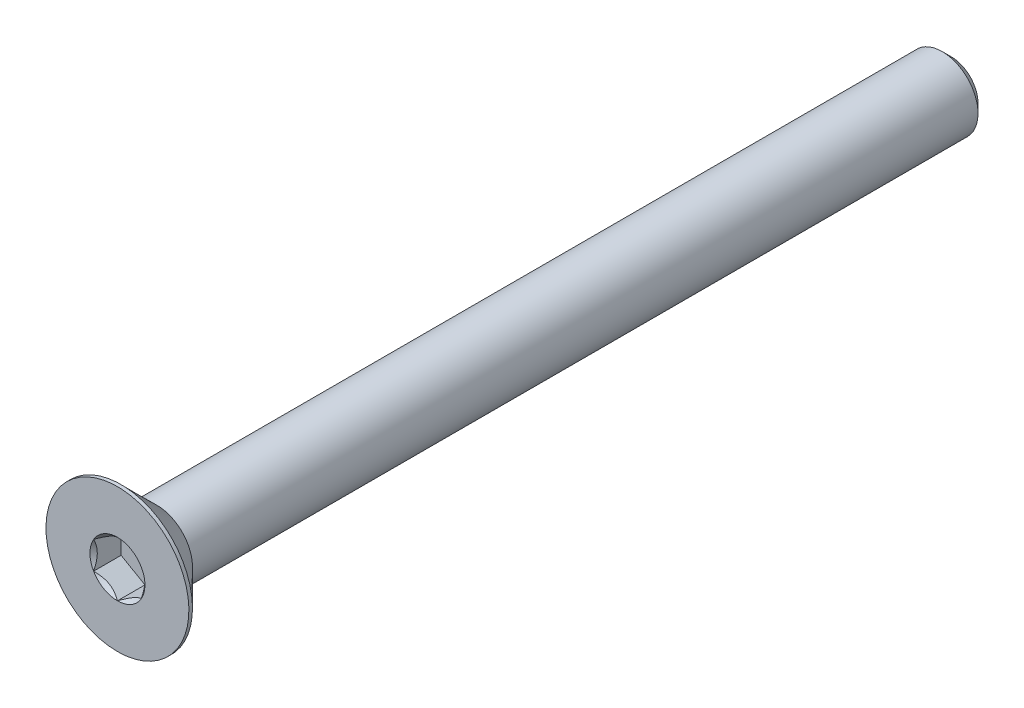
ISO-10303-21;
HEADER;
FILE_DESCRIPTION(('STEP AP214'),'2;1');
FILE_NAME('part.step','',(''),(''),'','','');
FILE_SCHEMA(('AUTOMOTIVE_DESIGN { 1 0 10303 214 1 1 1 1 }'));
ENDSEC;
DATA;
#1=APPLICATION_CONTEXT('core data for automotive mechanical design processes');
#2=APPLICATION_PROTOCOL_DEFINITION('international standard','automotive_design',2000,#1);
#3=PRODUCT_CONTEXT('',#1,'mechanical');
#4=PRODUCT('Part','Part','',(#3));
#5=PRODUCT_RELATED_PRODUCT_CATEGORY('part','',(#4));
#6=PRODUCT_DEFINITION_FORMATION('','',#4);
#7=PRODUCT_DEFINITION_CONTEXT('part definition',#1,'design');
#8=PRODUCT_DEFINITION('design','',#6,#7);
#9=PRODUCT_DEFINITION_SHAPE('','',#8);
#10=(LENGTH_UNIT() NAMED_UNIT(*) SI_UNIT(.MILLI.,.METRE.));
#11=(NAMED_UNIT(*) PLANE_ANGLE_UNIT() SI_UNIT($,.RADIAN.));
#12=(NAMED_UNIT(*) SI_UNIT($,.STERADIAN.) SOLID_ANGLE_UNIT());
#13=UNCERTAINTY_MEASURE_WITH_UNIT(LENGTH_MEASURE(1.E-05),#10,'distance_accuracy_value','');
#14=(GEOMETRIC_REPRESENTATION_CONTEXT(3) GLOBAL_UNCERTAINTY_ASSIGNED_CONTEXT((#13)) GLOBAL_UNIT_ASSIGNED_CONTEXT((#10,
#11,#12)) REPRESENTATION_CONTEXT('',''));
#15=CARTESIAN_POINT('',(0.,0.,0.));
#16=DIRECTION('',(0.,0.,1.));
#17=DIRECTION('',(1.,0.,0.));
#18=AXIS2_PLACEMENT_3D('',#15,#16,#17);
#19=CARTESIAN_POINT('',(0.,0.,-70.));
#20=DIRECTION('',(0.,0.,-1.));
#21=DIRECTION('',(0.,1.,0.));
#22=AXIS2_PLACEMENT_3D('',#19,#20,#21);
#23=CYLINDRICAL_SURFACE('',#22,3.);
#24=CARTESIAN_POINT('',(0.,0.,-69.25));
#25=DIRECTION('',(0.,0.,-1.));
#26=DIRECTION('',(0.,1.,0.));
#27=AXIS2_PLACEMENT_3D('',#24,#25,#26);
#28=CIRCLE('',#27,3.);
#29=CARTESIAN_POINT('',(0.,3.,-69.25));
#30=VERTEX_POINT('',#29);
#31=EDGE_CURVE('E48',#30,#30,#28,.F.);
#32=ORIENTED_EDGE('',*,*,#31,.T.);
#33=EDGE_LOOP('',(#32));
#34=FACE_BOUND('',#33,.T.);
#35=CARTESIAN_POINT('',(0.,0.,-3.3));
#36=DIRECTION('',(0.,0.,1.));
#37=DIRECTION('',(0.,-1.,0.));
#38=AXIS2_PLACEMENT_3D('',#35,#36,#37);
#39=CIRCLE('',#38,3.00000000000001);
#40=CARTESIAN_POINT('',(0.,-3.00000000000001,-3.29999999999999));
#41=VERTEX_POINT('',#40);
#42=EDGE_CURVE('E166',#41,#41,#39,.T.);
#43=ORIENTED_EDGE('',*,*,#42,.F.);
#44=EDGE_LOOP('',(#43));
#45=FACE_BOUND('',#44,.T.);
#46=ADVANCED_FACE('F35',(#34,#45),#23,.T.);
#47=CARTESIAN_POINT('',(0.,-3.,-70.));
#48=DIRECTION('',(0.,0.,-1.));
#49=DIRECTION('',(0.,1.,0.));
#50=AXIS2_PLACEMENT_3D('',#47,#48,#49);
#51=PLANE('',#50);
#52=CARTESIAN_POINT('',(0.,0.,-70.));
#53=DIRECTION('',(0.,0.,-1.));
#54=DIRECTION('',(0.,1.,0.));
#55=AXIS2_PLACEMENT_3D('',#52,#53,#54);
#56=CIRCLE('',#55,2.25);
#57=CARTESIAN_POINT('',(0.,2.25,-70.));
#58=VERTEX_POINT('',#57);
#59=EDGE_CURVE('E175',#58,#58,#56,.T.);
#60=ORIENTED_EDGE('',*,*,#59,.T.);
#61=EDGE_LOOP('',(#60));
#62=FACE_BOUND('',#61,.T.);
#63=ADVANCED_FACE('F185',(#62),#51,.T.);
#64=CARTESIAN_POINT('',(0.,0.,-70.));
#65=DIRECTION('',(0.,0.,1.));
#66=DIRECTION('',(0.,-1.,0.));
#67=AXIS2_PLACEMENT_3D('',#64,#65,#66);
#68=CONICAL_SURFACE('',#67,2.25,0.785398163397443);
#69=ORIENTED_EDGE('',*,*,#31,.F.);
#70=EDGE_LOOP('',(#69));
#71=FACE_BOUND('',#70,.T.);
#72=ORIENTED_EDGE('',*,*,#59,.F.);
#73=EDGE_LOOP('',(#72));
#74=FACE_BOUND('',#73,.T.);
#75=ADVANCED_FACE('F37',(#71,#74),#68,.T.);
#76=CARTESIAN_POINT('',(0.,0.,0.));
#77=DIRECTION('',(0.,0.,1.));
#78=DIRECTION('',(0.,-1.,0.));
#79=AXIS2_PLACEMENT_3D('',#76,#77,#78);
#80=CYLINDRICAL_SURFACE('',#79,6.);
#81=CARTESIAN_POINT('',(0.,0.,0.));
#82=DIRECTION('',(0.,0.,1.));
#83=DIRECTION('',(0.,-1.,0.));
#84=AXIS2_PLACEMENT_3D('',#81,#82,#83);
#85=CIRCLE('',#84,6.);
#86=CARTESIAN_POINT('',(0.,-6.,0.));
#87=VERTEX_POINT('',#86);
#88=EDGE_CURVE('E172',#87,#87,#85,.T.);
#89=ORIENTED_EDGE('',*,*,#88,.F.);
#90=EDGE_LOOP('',(#89));
#91=FACE_BOUND('',#90,.T.);
#92=CARTESIAN_POINT('',(0.,0.,-0.300000000000012));
#93=DIRECTION('',(0.,0.,1.));
#94=DIRECTION('',(0.,-1.,0.));
#95=AXIS2_PLACEMENT_3D('',#92,#93,#94);
#96=CIRCLE('',#95,6.);
#97=CARTESIAN_POINT('',(0.,-6.,-0.300000000000005));
#98=VERTEX_POINT('',#97);
#99=EDGE_CURVE('E169',#98,#98,#96,.T.);
#100=ORIENTED_EDGE('',*,*,#99,.T.);
#101=EDGE_LOOP('',(#100));
#102=FACE_BOUND('',#101,.T.);
#103=ADVANCED_FACE('F184',(#91,#102),#80,.T.);
#104=CARTESIAN_POINT('',(0.,0.,-3.3));
#105=DIRECTION('',(0.,0.,1.));
#106=DIRECTION('',(0.,-1.,0.));
#107=AXIS2_PLACEMENT_3D('',#104,#105,#106);
#108=CONICAL_SURFACE('',#107,3.00000000000001,0.785398163397449);
#109=ORIENTED_EDGE('',*,*,#99,.F.);
#110=EDGE_LOOP('',(#109));
#111=FACE_BOUND('',#110,.T.);
#112=ORIENTED_EDGE('',*,*,#42,.T.);
#113=EDGE_LOOP('',(#112));
#114=FACE_BOUND('',#113,.T.);
#115=ADVANCED_FACE('F195',(#111,#114),#108,.T.);
#116=CARTESIAN_POINT('',(0.,-3.,0.));
#117=DIRECTION('',(0.,0.,1.));
#118=DIRECTION('',(0.,-1.,0.));
#119=AXIS2_PLACEMENT_3D('',#116,#117,#118);
#120=PLANE('',#119);
#121=CARTESIAN_POINT('',(0.,0.,0.));
#122=DIRECTION('',(0.,0.,1.));
#123=DIRECTION('',(1.,0.,0.));
#124=AXIS2_PLACEMENT_3D('',#121,#122,#123);
#125=CIRCLE('',#124,2.3094010767585);
#126=CARTESIAN_POINT('',(0.,-2.3094010767585,0.));
#127=VERTEX_POINT('',#126);
#128=CARTESIAN_POINT('',(2.,-1.15470053837925,0.));
#129=VERTEX_POINT('',#128);
#130=EDGE_CURVE('E94',#127,#129,#125,.T.);
#131=ORIENTED_EDGE('',*,*,#130,.F.);
#132=CARTESIAN_POINT('',(-2.,-1.15470053837925,0.));
#133=VERTEX_POINT('',#132);
#134=EDGE_CURVE('E54',#133,#127,#125,.T.);
#135=ORIENTED_EDGE('',*,*,#134,.F.);
#136=CARTESIAN_POINT('',(-2.,1.15470053837925,0.));
#137=VERTEX_POINT('',#136);
#138=EDGE_CURVE('E136',#137,#133,#125,.T.);
#139=ORIENTED_EDGE('',*,*,#138,.F.);
#140=CARTESIAN_POINT('',(0.,2.3094010767585,0.));
#141=VERTEX_POINT('',#140);
#142=EDGE_CURVE('E61',#141,#137,#125,.T.);
#143=ORIENTED_EDGE('',*,*,#142,.F.);
#144=CARTESIAN_POINT('',(2.,1.15470053837925,0.));
#145=VERTEX_POINT('',#144);
#146=EDGE_CURVE('E130',#145,#141,#125,.T.);
#147=ORIENTED_EDGE('',*,*,#146,.F.);
#148=EDGE_CURVE('E102',#129,#145,#125,.T.);
#149=ORIENTED_EDGE('',*,*,#148,.F.);
#150=EDGE_LOOP('',(#131,#135,#139,#143,#147,#149));
#151=FACE_BOUND('',#150,.T.);
#152=ORIENTED_EDGE('',*,*,#88,.T.);
#153=EDGE_LOOP('',(#152));
#154=FACE_BOUND('',#153,.T.);
#155=ADVANCED_FACE('F128',(#151,#154),#120,.T.);
#156=CARTESIAN_POINT('',(0.,0.,0.));
#157=DIRECTION('',(0.,0.,1.));
#158=DIRECTION('',(1.,0.,0.));
#159=AXIS2_PLACEMENT_3D('',#156,#157,#158);
#160=CONICAL_SURFACE('',#159,2.3094010767585,0.78539816339745);
#161=ORIENTED_EDGE('',*,*,#148,.T.);
#162=CARTESIAN_POINT('',(2.,-2.3029441732643,0.740771355280704));
#163=CARTESIAN_POINT('',(2.,-2.24687002696279,0.698443273869204));
#164=CARTESIAN_POINT('',(2.,-2.19048190568583,0.656525157097849));
#165=CARTESIAN_POINT('',(2.,-2.07695390526152,0.573690418075127));
#166=CARTESIAN_POINT('',(2.,-2.01981384095229,0.53277404987251));
#167=CARTESIAN_POINT('',(2.,-1.90424016831614,0.451833452203585));
#168=CARTESIAN_POINT('',(2.,-1.84579996769763,0.411818591735152));
#169=CARTESIAN_POINT('',(2.,-1.72792745485625,0.33328899382026));
#170=CARTESIAN_POINT('',(2.,-1.66849521315186,0.294774150389528));
#171=CARTESIAN_POINT('',(2.,-1.48162995729573,0.17764065172027));
#172=CARTESIAN_POINT('',(2.,-1.35220318180736,0.102145901825278));
#173=CARTESIAN_POINT('',(2.,-1.08689521605219,-0.035950648947696));
#174=CARTESIAN_POINT('',(2.,-0.951037764035625,-0.0985959140559766));
#175=CARTESIAN_POINT('',(2.,-0.747111912337646,-0.175236456097241));
#176=CARTESIAN_POINT('',(2.,-0.682064034234152,-0.197232820052757));
#177=CARTESIAN_POINT('',(2.,-0.550398103397368,-0.23600331231236));
#178=CARTESIAN_POINT('',(2.,-0.483779942833393,-0.25277708085244));
#179=CARTESIAN_POINT('',(2.,-0.350484328974901,-0.279951742093306));
#180=CARTESIAN_POINT('',(2.,-0.283829489500056,-0.290461823239021));
#181=CARTESIAN_POINT('',(2.,-0.149806987290426,-0.304903914443519));
#182=CARTESIAN_POINT('',(2.,-0.0824394490929267,-0.308837055260091));
#183=CARTESIAN_POINT('',(2.,0.0499055621213762,-0.309833523070379));
#184=CARTESIAN_POINT('',(2.,0.114881284963485,-0.307140355159719));
#185=CARTESIAN_POINT('',(2.,0.244275921290584,-0.295569929600436));
#186=CARTESIAN_POINT('',(2.,0.308694780068661,-0.286692071196874));
#187=CARTESIAN_POINT('',(2.,0.437599788400934,-0.26308634074856));
#188=CARTESIAN_POINT('',(2.,0.502067428429079,-0.248258916605879));
#189=CARTESIAN_POINT('',(2.,0.629594322371855,-0.213542116439957));
#190=CARTESIAN_POINT('',(2.,0.692653693651508,-0.193653163969504));
#191=CARTESIAN_POINT('',(2.,0.891187888928463,-0.123553020856597));
#192=CARTESIAN_POINT('',(2.,1.02383545674826,-0.0653581998253442));
#193=CARTESIAN_POINT('',(2.,1.28290932109378,0.0640305752408587));
#194=CARTESIAN_POINT('',(2.,1.40931112542932,0.13527123115829));
#195=CARTESIAN_POINT('',(2.,1.59200441388854,0.246441991562721));
#196=CARTESIAN_POINT('',(2.,1.65027548974481,0.283182190008324));
#197=CARTESIAN_POINT('',(2.,1.76581760334353,0.358214513820533));
#198=CARTESIAN_POINT('',(2.,1.82308856486637,0.396506756737678));
#199=CARTESIAN_POINT('',(2.,1.93629654702499,0.474042263666801));
#200=CARTESIAN_POINT('',(2.,1.99224062439414,0.513275275702229));
#201=CARTESIAN_POINT('',(2.,2.10336423965704,0.592778830271317));
#202=CARTESIAN_POINT('',(2.,2.15854398356743,0.633049084518487));
#203=CARTESIAN_POINT('',(2.,2.21340370625405,0.673744237646943));
#204=B_SPLINE_CURVE_WITH_KNOTS('',3,(#162,#163,#164,#165,#166,#167,#168,#169,#170,#171,#172,
#173,#174,#175,#176,#177,#178,#179,#180,#181,#182,#183,#184,#185,#186,#187,#188,#189,#190,#191,
#192,#193,#194,#195,#196,#197,#198,#199,#200,#201,#202,#203),.UNSPECIFIED.,.F.,.F.,(4,2,2,2,2,2,
2,2,2,2,2,2,2,2,2,2,2,2,2,2,4),(0.,0.210772732017009,0.421598374738838,0.634057554744621,
0.846501696032181,1.29562155480994,1.74319622856097,1.94902062142334,2.15485918958132,
2.35699582530216,2.55909770457495,2.75388435576874,2.94868993036093,3.14690093471669,
3.34509535806591,3.77838155838771,4.21325029906866,4.41989056664096,4.62654651432579,
4.83152377076248,5.03644465872344),.UNSPECIFIED.);
#205=EDGE_CURVE('E11',#129,#145,#204,.T.);
#206=ORIENTED_EDGE('',*,*,#205,.F.);
#207=EDGE_LOOP('',(#161,#206));
#208=FACE_BOUND('',#207,.T.);
#209=ADVANCED_FACE('F106',(#208),#160,.F.);
#210=ORIENTED_EDGE('',*,*,#146,.T.);
#211=CARTESIAN_POINT('',(2.0002,1.15458506832541,0.000115478713658772));
#212=CARTESIAN_POINT('',(1.93144696596929,1.19427965103065,-0.0395469097744085));
#213=CARTESIAN_POINT('',(1.86154425786449,1.23463799837204,-0.0768800177158387));
#214=CARTESIAN_POINT('',(1.71900475544956,1.31693321846145,-0.145236314863858));
#215=CARTESIAN_POINT('',(1.64635440243464,1.35887791933134,-0.17622146626278));
#216=CARTESIAN_POINT('',(1.49985839894603,1.44345742638069,-0.229299783455858));
#217=CARTESIAN_POINT('',(1.4260500647537,1.48607068799507,-0.251526372823389));
#218=CARTESIAN_POINT('',(1.27680836816474,1.57223542169503,-0.28577118332492));
#219=CARTESIAN_POINT('',(1.20137956608185,1.61578426088223,-0.297814970855866));
#220=CARTESIAN_POINT('',(1.07138449932892,1.69083694766536,-0.308681488094429));
#221=CARTESIAN_POINT('',(1.01698621602989,1.72224381117151,-0.31029024639003));
#222=CARTESIAN_POINT('',(0.908278544480306,1.78500621460364,-0.307581122401289));
#223=CARTESIAN_POINT('',(0.85396919407866,1.81636173267754,-0.303261162242026));
#224=CARTESIAN_POINT('',(0.745863272410661,1.87877671565355,-0.288940432590095));
#225=CARTESIAN_POINT('',(0.692067343445207,1.90983580972306,-0.278933307237994));
#226=CARTESIAN_POINT('',(0.585405737694425,1.97141691651548,-0.253787569750341));
#227=CARTESIAN_POINT('',(0.532539989929286,2.00193897021859,-0.23864935095776));
#228=CARTESIAN_POINT('',(0.397120266910155,2.08012358375727,-0.193705496570809));
#229=CARTESIAN_POINT('',(0.315406165150521,2.12730124240478,-0.160511160574184));
#230=CARTESIAN_POINT('',(0.195252962742197,2.19667172615922,-0.10447417682863));
#231=CARTESIAN_POINT('',(0.155657147890823,2.21953238052245,-0.0847852970530602));
#232=CARTESIAN_POINT('',(0.0771990411121277,2.26483018959124,-0.043612681635129));
#233=CARTESIAN_POINT('',(0.0383363164062597,2.28726759416161,-0.0221300483487535));
#234=CARTESIAN_POINT('',(-0.000199999999999904,2.30951654681234,0.000115478713659038));
#235=B_SPLINE_CURVE_WITH_KNOTS('',3,(#211,#212,#213,#214,#215,#216,#217,#218,#219,#220,#221,
#222,#223,#224,#225,#226,#227,#228,#229,#230,#231,#232,#233,#234),.UNSPECIFIED.,.F.,.F.,(4,2,2,
2,2,2,2,2,2,2,2,4),(0.,0.266420613771064,0.534393751523389,0.798110374376914,1.06116288956936,
1.24939906803722,1.43770123566247,1.62621426093932,1.81471283831913,2.11415604834145,
2.2634717071779,2.41269626969771),.UNSPECIFIED.);
#236=EDGE_CURVE('E132',#145,#141,#235,.T.);
#237=ORIENTED_EDGE('',*,*,#236,.F.);
#238=EDGE_LOOP('',(#210,#237));
#239=FACE_BOUND('',#238,.T.);
#240=ADVANCED_FACE('F271',(#239),#160,.F.);
#241=ORIENTED_EDGE('',*,*,#142,.T.);
#242=CARTESIAN_POINT('',(0.000200000000000235,2.30951654681234,0.000115478713659074));
#243=CARTESIAN_POINT('',(-0.0685530340307053,2.26982196410711,-0.0395469097744084));
#244=CARTESIAN_POINT('',(-0.138455742135511,2.22946361676572,-0.0768800177158387));
#245=CARTESIAN_POINT('',(-0.280995244550437,2.1471683966763,-0.145236314863857));
#246=CARTESIAN_POINT('',(-0.353645597565359,2.10522369580642,-0.17622146626278));
#247=CARTESIAN_POINT('',(-0.500141601053972,2.02064418875706,-0.229299783455858));
#248=CARTESIAN_POINT('',(-0.573949935246295,1.97803092714269,-0.25152637282339));
#249=CARTESIAN_POINT('',(-0.723191631835265,1.89186619344273,-0.28577118332492));
#250=CARTESIAN_POINT('',(-0.798620433918153,1.84831735425552,-0.297814970855866));
#251=CARTESIAN_POINT('',(-0.92861550067108,1.7732646674724,-0.308681488094429));
#252=CARTESIAN_POINT('',(-0.98301378397011,1.74185780396625,-0.31029024639003));
#253=CARTESIAN_POINT('',(-1.09172145551969,1.67909540053412,-0.307581122401289));
#254=CARTESIAN_POINT('',(-1.14603080592134,1.64773988246021,-0.303261162242026));
#255=CARTESIAN_POINT('',(-1.25413672758934,1.5853248994842,-0.288940432590094));
#256=CARTESIAN_POINT('',(-1.30793265655479,1.55426580541469,-0.278933307237994));
#257=CARTESIAN_POINT('',(-1.41459426230558,1.49268469862228,-0.253787569750341));
#258=CARTESIAN_POINT('',(-1.46746001007071,1.46216264491917,-0.23864935095776));
#259=CARTESIAN_POINT('',(-1.60287973308985,1.38397803138049,-0.193705496570809));
#260=CARTESIAN_POINT('',(-1.68459383484948,1.33680037273297,-0.160511160574184));
#261=CARTESIAN_POINT('',(-1.8047470372578,1.26742988897853,-0.10447417682863));
#262=CARTESIAN_POINT('',(-1.84434285210918,1.24456923461531,-0.0847852970530601));
#263=CARTESIAN_POINT('',(-1.92280095888787,1.19927142554652,-0.043612681635129));
#264=CARTESIAN_POINT('',(-1.96166368359374,1.17683402097614,-0.0221300483487535));
#265=CARTESIAN_POINT('',(-2.0002,1.15458506832541,0.00011547871365885));
#266=B_SPLINE_CURVE_WITH_KNOTS('',3,(#242,#243,#244,#245,#246,#247,#248,#249,#250,#251,#252,
#253,#254,#255,#256,#257,#258,#259,#260,#261,#262,#263,#264,#265),.UNSPECIFIED.,.F.,.F.,(4,2,2,
2,2,2,2,2,2,2,2,4),(0.,0.266420613771064,0.534393751523389,0.798110374376915,1.06116288956936,
1.24939906803722,1.43770123566248,1.62621426093932,1.81471283831913,2.11415604834145,
2.26347170717791,2.41269626969771),.UNSPECIFIED.);
#267=EDGE_CURVE('E135',#141,#137,#266,.T.);
#268=ORIENTED_EDGE('',*,*,#267,.F.);
#269=EDGE_LOOP('',(#241,#268));
#270=FACE_BOUND('',#269,.T.);
#271=ADVANCED_FACE('F267',(#270),#160,.F.);
#272=ORIENTED_EDGE('',*,*,#138,.T.);
#273=CARTESIAN_POINT('',(-2.,-2.30294417292923,0.740771355027722));
#274=CARTESIAN_POINT('',(-2.,-2.24687002663712,0.698443273625965));
#275=CARTESIAN_POINT('',(-2.,-2.19048190536959,0.656525156864339));
#276=CARTESIAN_POINT('',(-2.,-2.07695390496424,0.573690417861019));
#277=CARTESIAN_POINT('',(-2.,-2.01981384066454,0.532774049668075));
#278=CARTESIAN_POINT('',(-2.,-1.90424016804776,0.451833452018564));
#279=CARTESIAN_POINT('',(-2.,-1.8457999674391,0.411818591559869));
#280=CARTESIAN_POINT('',(-2.,-1.7279274546176,0.333288993664294));
#281=CARTESIAN_POINT('',(-2.,-1.66849521292324,0.294774150243143));
#282=CARTESIAN_POINT('',(-2.,-1.4816299571002,0.177640651604295));
#283=CARTESIAN_POINT('',(-2.,-1.35220318163536,0.102145901729644));
#284=CARTESIAN_POINT('',(-2.,-1.08689521592924,-0.0359506490056187));
#285=CARTESIAN_POINT('',(-2.,-0.951037763938191,-0.0985959140965042));
#286=CARTESIAN_POINT('',(-2.,-0.747111912259408,-0.175236456124857));
#287=CARTESIAN_POINT('',(-2.,-0.682064034147875,-0.197232820080877));
#288=CARTESIAN_POINT('',(-2.,-0.550398103294751,-0.23600331233986));
#289=CARTESIAN_POINT('',(-2.,-0.483779942722475,-0.252777080878817));
#290=CARTESIAN_POINT('',(-2.,-0.350484328847654,-0.279951742115555));
#291=CARTESIAN_POINT('',(-2.,-0.283829489364785,-0.290461823258314));
#292=CARTESIAN_POINT('',(-2.,-0.149806987139376,-0.304903914455084));
#293=CARTESIAN_POINT('',(-2.,-0.0824394489341213,-0.308837055266886));
#294=CARTESIAN_POINT('',(-2.,0.0499055622944901,-0.309833523066283));
#295=CARTESIAN_POINT('',(-2.,0.114881285143173,-0.307140355149591));
#296=CARTESIAN_POINT('',(-2.,0.244275921482761,-0.295569929577308));
#297=CARTESIAN_POINT('',(-2.,0.308694780266753,-0.286692071166776));
#298=CARTESIAN_POINT('',(-2.,0.437599788610705,-0.263086340703852));
#299=CARTESIAN_POINT('',(-2.,0.502067428644595,-0.248258916553488));
#300=CARTESIAN_POINT('',(-2.,0.629594322598307,-0.21354211637203));
#301=CARTESIAN_POINT('',(-2.,0.692653693883151,-0.193653163893724));
#302=CARTESIAN_POINT('',(-2.,0.891187889210545,-0.123553020743801));
#303=CARTESIAN_POINT('',(-2.,1.02383545707306,-0.0653581996784914));
#304=CARTESIAN_POINT('',(-2.,1.28290932150074,0.0640305754595761));
#305=CARTESIAN_POINT('',(-2.,1.4093111258757,0.135271231414841));
#306=CARTESIAN_POINT('',(-2.,1.59200441438963,0.24644199187472));
#307=CARTESIAN_POINT('',(-2.,1.65027549026191,0.283182190337374));
#308=CARTESIAN_POINT('',(-2.,1.76581760389243,0.358214514183765));
#309=CARTESIAN_POINT('',(-2.,1.82308856543105,0.396506757118039));
#310=CARTESIAN_POINT('',(-2.,1.93629654762084,0.474042264081225));
#311=CARTESIAN_POINT('',(-2.,1.99224062500539,0.513275276133584));
#312=CARTESIAN_POINT('',(-2.,2.103364240299,0.592778830736515));
#313=CARTESIAN_POINT('',(-2.,2.15854398422468,0.633049085000596));
#314=CARTESIAN_POINT('',(-2.,2.21340370692659,0.673744238145941));
#315=B_SPLINE_CURVE_WITH_KNOTS('',3,(#273,#274,#275,#276,#277,#278,#279,#280,#281,#282,#283,
#284,#285,#286,#287,#288,#289,#290,#291,#292,#293,#294,#295,#296,#297,#298,#299,#300,#301,#302,
#303,#304,#305,#306,#307,#308,#309,#310,#311,#312,#313,#314),.UNSPECIFIED.,.F.,.F.,(4,2,2,2,2,2,
2,2,2,2,2,2,2,2,2,2,2,2,2,2,4),(0.,0.210772731976891,0.421598374658589,0.634057554623488,
0.84650169587017,1.29562155455624,1.74319622821645,1.94902062110207,2.15485918928326,
2.35699582502635,2.5590977043214,2.75388435553556,2.94868993014815,3.14690093452586,
3.34509535789702,3.77838155837654,4.21325029921625,4.41989056685647,4.62654651460921,
4.8315237711129,5.03644465914085),.UNSPECIFIED.);
#316=EDGE_CURVE('E142',#137,#133,#315,.F.);
#317=ORIENTED_EDGE('',*,*,#316,.F.);
#318=EDGE_LOOP('',(#272,#317));
#319=FACE_BOUND('',#318,.T.);
#320=ADVANCED_FACE('F140',(#319),#160,.F.);
#321=ORIENTED_EDGE('',*,*,#134,.T.);
#322=CARTESIAN_POINT('',(-2.0002,-1.15458506832541,0.000115478713658772));
#323=CARTESIAN_POINT('',(-1.93144696596929,-1.19427965103064,-0.039546909774409));
#324=CARTESIAN_POINT('',(-1.86154425786449,-1.23463799837204,-0.0768800177158392));
#325=CARTESIAN_POINT('',(-1.71900475544956,-1.31693321846145,-0.145236314863858));
#326=CARTESIAN_POINT('',(-1.64635440243464,-1.35887791933134,-0.17622146626278));
#327=CARTESIAN_POINT('',(-1.49985839894603,-1.44345742638069,-0.229299783455858));
#328=CARTESIAN_POINT('',(-1.42605006475371,-1.48607068799507,-0.25152637282339));
#329=CARTESIAN_POINT('',(-1.27680836816474,-1.57223542169503,-0.28577118332492));
#330=CARTESIAN_POINT('',(-1.20137956608185,-1.61578426088223,-0.297814970855866));
#331=CARTESIAN_POINT('',(-1.07138449932892,-1.69083694766536,-0.308681488094429));
#332=CARTESIAN_POINT('',(-1.01698621602989,-1.72224381117151,-0.31029024639003));
#333=CARTESIAN_POINT('',(-0.908278544480307,-1.78500621460364,-0.30758112240129));
#334=CARTESIAN_POINT('',(-0.853969194078661,-1.81636173267754,-0.303261162242027));
#335=CARTESIAN_POINT('',(-0.745863272410662,-1.87877671565355,-0.288940432590095));
#336=CARTESIAN_POINT('',(-0.692067343445208,-1.90983580972306,-0.278933307237994));
#337=CARTESIAN_POINT('',(-0.585405737694427,-1.97141691651547,-0.253787569750341));
#338=CARTESIAN_POINT('',(-0.532539989929288,-2.00193897021859,-0.238649350957761));
#339=CARTESIAN_POINT('',(-0.397120266910156,-2.08012358375727,-0.193705496570811));
#340=CARTESIAN_POINT('',(-0.315406165150522,-2.12730124240478,-0.160511160574185));
#341=CARTESIAN_POINT('',(-0.195252962742198,-2.19667172615922,-0.104474176828631));
#342=CARTESIAN_POINT('',(-0.155657147890824,-2.21953238052245,-0.0847852970530612));
#343=CARTESIAN_POINT('',(-0.0771990411121287,-2.26483018959123,-0.04361268163513));
#344=CARTESIAN_POINT('',(-0.0383363164062605,-2.28726759416161,-0.0221300483487543));
#345=CARTESIAN_POINT('',(0.000199999999999211,-2.30951654681234,0.000115478713658337));
#346=B_SPLINE_CURVE_WITH_KNOTS('',3,(#322,#323,#324,#325,#326,#327,#328,#329,#330,#331,#332,
#333,#334,#335,#336,#337,#338,#339,#340,#341,#342,#343,#344,#345),.UNSPECIFIED.,.F.,.F.,(4,2,2,
2,2,2,2,2,2,2,2,4),(0.,0.266420613771064,0.534393751523388,0.798110374376914,1.06116288956936,
1.24939906803722,1.43770123566247,1.62621426093932,1.81471283831913,2.11415604834145,
2.2634717071779,2.41269626969771),.UNSPECIFIED.);
#347=EDGE_CURVE('E118',#133,#127,#346,.T.);
#348=ORIENTED_EDGE('',*,*,#347,.F.);
#349=EDGE_LOOP('',(#321,#348));
#350=FACE_BOUND('',#349,.T.);
#351=ADVANCED_FACE('F222',(#350),#160,.F.);
#352=ORIENTED_EDGE('',*,*,#130,.T.);
#353=CARTESIAN_POINT('',(-0.000200000000000701,-2.30951654681234,0.000115478713658207));
#354=CARTESIAN_POINT('',(0.0685530340307049,-2.26982196410711,-0.039546909774409));
#355=CARTESIAN_POINT('',(0.138455742135511,-2.22946361676572,-0.0768800177158393));
#356=CARTESIAN_POINT('',(0.280995244550436,-2.1471683966763,-0.145236314863858));
#357=CARTESIAN_POINT('',(0.353645597565358,-2.10522369580642,-0.176221466262781));
#358=CARTESIAN_POINT('',(0.500141601053971,-2.02064418875706,-0.229299783455859));
#359=CARTESIAN_POINT('',(0.573949935246294,-1.97803092714269,-0.25152637282339));
#360=CARTESIAN_POINT('',(0.723191631835264,-1.89186619344273,-0.28577118332492));
#361=CARTESIAN_POINT('',(0.798620433918151,-1.84831735425552,-0.297814970855866));
#362=CARTESIAN_POINT('',(0.928615500671079,-1.7732646674724,-0.308681488094429));
#363=CARTESIAN_POINT('',(0.983013783970108,-1.74185780396625,-0.31029024639003));
#364=CARTESIAN_POINT('',(1.09172145551969,-1.67909540053412,-0.30758112240129));
#365=CARTESIAN_POINT('',(1.14603080592134,-1.64773988246021,-0.303261162242027));
#366=CARTESIAN_POINT('',(1.25413672758934,-1.5853248994842,-0.288940432590095));
#367=CARTESIAN_POINT('',(1.30793265655479,-1.55426580541469,-0.278933307237995));
#368=CARTESIAN_POINT('',(1.41459426230557,-1.49268469862228,-0.253787569750341));
#369=CARTESIAN_POINT('',(1.46746001007071,-1.46216264491917,-0.238649350957761));
#370=CARTESIAN_POINT('',(1.60287973308984,-1.38397803138049,-0.19370549657081));
#371=CARTESIAN_POINT('',(1.68459383484948,-1.33680037273297,-0.160511160574185));
#372=CARTESIAN_POINT('',(1.8047470372578,-1.26742988897853,-0.10447417682863));
#373=CARTESIAN_POINT('',(1.84434285210918,-1.24456923461531,-0.0847852970530598));
#374=CARTESIAN_POINT('',(1.92280095888787,-1.19927142554652,-0.0436126816351283));
#375=CARTESIAN_POINT('',(1.96166368359374,-1.17683402097614,-0.0221300483487529));
#376=CARTESIAN_POINT('',(2.0002,-1.15458506832541,0.000115478713659091));
#377=B_SPLINE_CURVE_WITH_KNOTS('',3,(#353,#354,#355,#356,#357,#358,#359,#360,#361,#362,#363,
#364,#365,#366,#367,#368,#369,#370,#371,#372,#373,#374,#375,#376),.UNSPECIFIED.,.F.,.F.,(4,2,2,
2,2,2,2,2,2,2,2,4),(0.,0.266420613771063,0.534393751523388,0.798110374376914,1.06116288956936,
1.24939906803722,1.43770123566247,1.62621426093932,1.81471283831913,2.11415604834145,
2.26347170717791,2.41269626969771),.UNSPECIFIED.);
#378=EDGE_CURVE('E98',#127,#129,#377,.T.);
#379=ORIENTED_EDGE('',*,*,#378,.F.);
#380=EDGE_LOOP('',(#352,#379));
#381=FACE_BOUND('',#380,.T.);
#382=ADVANCED_FACE('F96',(#381),#160,.F.);
#383=CARTESIAN_POINT('',(2.,-1.15470053837925,-2.31));
#384=DIRECTION('',(0.,0.,1.));
#385=DIRECTION('',(1.,0.,0.));
#386=AXIS2_PLACEMENT_3D('',#383,#384,#385);
#387=PLANE('',#386);
#388=DIRECTION('',(0.866025403784439,0.499999999999999,0.));
#389=VECTOR('',#388,1.);
#390=CARTESIAN_POINT('',(0.,-2.3094010767585,-2.31));
#391=LINE('',#390,#389);
#392=CARTESIAN_POINT('',(0.,-2.3094010767585,-2.31));
#393=VERTEX_POINT('',#392);
#394=CARTESIAN_POINT('',(2.,-1.15470053837925,-2.31));
#395=VERTEX_POINT('',#394);
#396=EDGE_CURVE('E117',#393,#395,#391,.T.);
#397=ORIENTED_EDGE('',*,*,#396,.T.);
#398=DIRECTION('',(0.,1.,0.));
#399=VECTOR('',#398,1.);
#400=CARTESIAN_POINT('',(2.,-1.15470053837925,-2.31));
#401=LINE('',#400,#399);
#402=CARTESIAN_POINT('',(2.,1.15470053837925,-2.31));
#403=VERTEX_POINT('',#402);
#404=EDGE_CURVE('E122',#395,#403,#401,.T.);
#405=ORIENTED_EDGE('',*,*,#404,.T.);
#406=DIRECTION('',(-0.866025403784439,0.5,0.));
#407=VECTOR('',#406,1.);
#408=CARTESIAN_POINT('',(2.,1.15470053837925,-2.31));
#409=LINE('',#408,#407);
#410=CARTESIAN_POINT('',(0.,2.3094010767585,-2.31));
#411=VERTEX_POINT('',#410);
#412=EDGE_CURVE('E253',#403,#411,#409,.T.);
#413=ORIENTED_EDGE('',*,*,#412,.T.);
#414=DIRECTION('',(-0.866025403784439,-0.5,0.));
#415=VECTOR('',#414,1.);
#416=CARTESIAN_POINT('',(0.,2.3094010767585,-2.31));
#417=LINE('',#416,#415);
#418=CARTESIAN_POINT('',(-2.,1.15470053837925,-2.31));
#419=VERTEX_POINT('',#418);
#420=EDGE_CURVE('E255',#411,#419,#417,.T.);
#421=ORIENTED_EDGE('',*,*,#420,.T.);
#422=DIRECTION('',(0.,-1.,0.));
#423=VECTOR('',#422,1.);
#424=CARTESIAN_POINT('',(-2.,1.15470053837925,-2.31));
#425=LINE('',#424,#423);
#426=CARTESIAN_POINT('',(-2.,-1.15470053837925,-2.31));
#427=VERTEX_POINT('',#426);
#428=EDGE_CURVE('E157',#419,#427,#425,.T.);
#429=ORIENTED_EDGE('',*,*,#428,.T.);
#430=DIRECTION('',(0.866025403784439,-0.5,0.));
#431=VECTOR('',#430,1.);
#432=CARTESIAN_POINT('',(-2.,-1.15470053837925,-2.31));
#433=LINE('',#432,#431);
#434=EDGE_CURVE('E125',#427,#393,#433,.T.);
#435=ORIENTED_EDGE('',*,*,#434,.T.);
#436=EDGE_LOOP('',(#397,#405,#413,#421,#429,#435));
#437=FACE_BOUND('',#436,.T.);
#438=ADVANCED_FACE('F221',(#437),#387,.T.);
#439=CARTESIAN_POINT('',(2.,-1.15470053837925,-2.31));
#440=DIRECTION('',(1.,0.,0.));
#441=DIRECTION('',(0.,1.,0.));
#442=AXIS2_PLACEMENT_3D('',#439,#440,#441);
#443=PLANE('',#442);
#444=DIRECTION('',(0.,0.,1.));
#445=VECTOR('',#444,1.);
#446=CARTESIAN_POINT('',(2.,-1.15470053837925,-2.31));
#447=LINE('',#446,#445);
#448=EDGE_CURVE('E114',#395,#129,#447,.T.);
#449=ORIENTED_EDGE('',*,*,#448,.T.);
#450=ORIENTED_EDGE('',*,*,#205,.T.);
#451=DIRECTION('',(0.,0.,1.));
#452=VECTOR('',#451,1.);
#453=CARTESIAN_POINT('',(2.,1.15470053837925,-2.31));
#454=LINE('',#453,#452);
#455=EDGE_CURVE('E124',#403,#145,#454,.T.);
#456=ORIENTED_EDGE('',*,*,#455,.F.);
#457=ORIENTED_EDGE('',*,*,#404,.F.);
#458=EDGE_LOOP('',(#449,#450,#456,#457));
#459=FACE_BOUND('',#458,.T.);
#460=ADVANCED_FACE('F120',(#459),#443,.F.);
#461=CARTESIAN_POINT('',(2.,1.15470053837925,-2.31));
#462=DIRECTION('',(0.5,0.866025403784439,0.));
#463=DIRECTION('',(-0.866025403784439,0.5,0.));
#464=AXIS2_PLACEMENT_3D('',#461,#462,#463);
#465=PLANE('',#464);
#466=ORIENTED_EDGE('',*,*,#455,.T.);
#467=ORIENTED_EDGE('',*,*,#236,.T.);
#468=DIRECTION('',(0.,0.,1.));
#469=VECTOR('',#468,1.);
#470=CARTESIAN_POINT('',(0.,2.3094010767585,-2.31));
#471=LINE('',#470,#469);
#472=EDGE_CURVE('E153',#411,#141,#471,.T.);
#473=ORIENTED_EDGE('',*,*,#472,.F.);
#474=ORIENTED_EDGE('',*,*,#412,.F.);
#475=EDGE_LOOP('',(#466,#467,#473,#474));
#476=FACE_BOUND('',#475,.T.);
#477=ADVANCED_FACE('F244',(#476),#465,.F.);
#478=CARTESIAN_POINT('',(0.,2.3094010767585,-2.31));
#479=DIRECTION('',(-0.5,0.866025403784439,0.));
#480=DIRECTION('',(-0.866025403784439,-0.5,0.));
#481=AXIS2_PLACEMENT_3D('',#478,#479,#480);
#482=PLANE('',#481);
#483=ORIENTED_EDGE('',*,*,#472,.T.);
#484=ORIENTED_EDGE('',*,*,#267,.T.);
#485=DIRECTION('',(0.,0.,1.));
#486=VECTOR('',#485,1.);
#487=CARTESIAN_POINT('',(-2.,1.15470053837925,-2.31));
#488=LINE('',#487,#486);
#489=EDGE_CURVE('E151',#419,#137,#488,.T.);
#490=ORIENTED_EDGE('',*,*,#489,.F.);
#491=ORIENTED_EDGE('',*,*,#420,.F.);
#492=EDGE_LOOP('',(#483,#484,#490,#491));
#493=FACE_BOUND('',#492,.T.);
#494=ADVANCED_FACE('F149',(#493),#482,.F.);
#495=CARTESIAN_POINT('',(-2.,1.15470053837925,-2.31));
#496=DIRECTION('',(-1.,0.,0.));
#497=DIRECTION('',(0.,0.,1.));
#498=AXIS2_PLACEMENT_3D('',#495,#496,#497);
#499=PLANE('',#498);
#500=ORIENTED_EDGE('',*,*,#489,.T.);
#501=ORIENTED_EDGE('',*,*,#316,.T.);
#502=DIRECTION('',(0.,0.,1.));
#503=VECTOR('',#502,1.);
#504=CARTESIAN_POINT('',(-2.,-1.15470053837925,-2.31));
#505=LINE('',#504,#503);
#506=EDGE_CURVE('E159',#427,#133,#505,.T.);
#507=ORIENTED_EDGE('',*,*,#506,.F.);
#508=ORIENTED_EDGE('',*,*,#428,.F.);
#509=EDGE_LOOP('',(#500,#501,#507,#508));
#510=FACE_BOUND('',#509,.T.);
#511=ADVANCED_FACE('F155',(#510),#499,.F.);
#512=CARTESIAN_POINT('',(-2.,-1.15470053837925,-2.31));
#513=DIRECTION('',(-0.5,-0.866025403784439,0.));
#514=DIRECTION('',(0.866025403784439,-0.5,0.));
#515=AXIS2_PLACEMENT_3D('',#512,#513,#514);
#516=PLANE('',#515);
#517=ORIENTED_EDGE('',*,*,#506,.T.);
#518=ORIENTED_EDGE('',*,*,#347,.T.);
#519=DIRECTION('',(0.,0.,1.));
#520=VECTOR('',#519,1.);
#521=CARTESIAN_POINT('',(0.,-2.3094010767585,-2.31));
#522=LINE('',#521,#520);
#523=EDGE_CURVE('E116',#393,#127,#522,.T.);
#524=ORIENTED_EDGE('',*,*,#523,.F.);
#525=ORIENTED_EDGE('',*,*,#434,.F.);
#526=EDGE_LOOP('',(#517,#518,#524,#525));
#527=FACE_BOUND('',#526,.T.);
#528=ADVANCED_FACE('F205',(#527),#516,.F.);
#529=CARTESIAN_POINT('',(0.,-2.3094010767585,-2.31));
#530=DIRECTION('',(0.499999999999999,-0.866025403784439,0.));
#531=DIRECTION('',(0.866025403784439,0.5,0.));
#532=AXIS2_PLACEMENT_3D('',#529,#530,#531);
#533=PLANE('',#532);
#534=ORIENTED_EDGE('',*,*,#523,.T.);
#535=ORIENTED_EDGE('',*,*,#378,.T.);
#536=ORIENTED_EDGE('',*,*,#448,.F.);
#537=ORIENTED_EDGE('',*,*,#396,.F.);
#538=EDGE_LOOP('',(#534,#535,#536,#537));
#539=FACE_BOUND('',#538,.T.);
#540=ADVANCED_FACE('F112',(#539),#533,.F.);
#541=CLOSED_SHELL('',(#46,#63,#75,#103,#115,#155,#209,#240,#271,#320,#351,#382,#438,#460,#477,
#494,#511,#528,#540));
#542=MANIFOLD_SOLID_BREP('B2',#541);
#543=ADVANCED_BREP_SHAPE_REPRESENTATION('',(#18,#542),#14);
#544=SHAPE_DEFINITION_REPRESENTATION(#9,#543);
ENDSEC;
END-ISO-10303-21;
